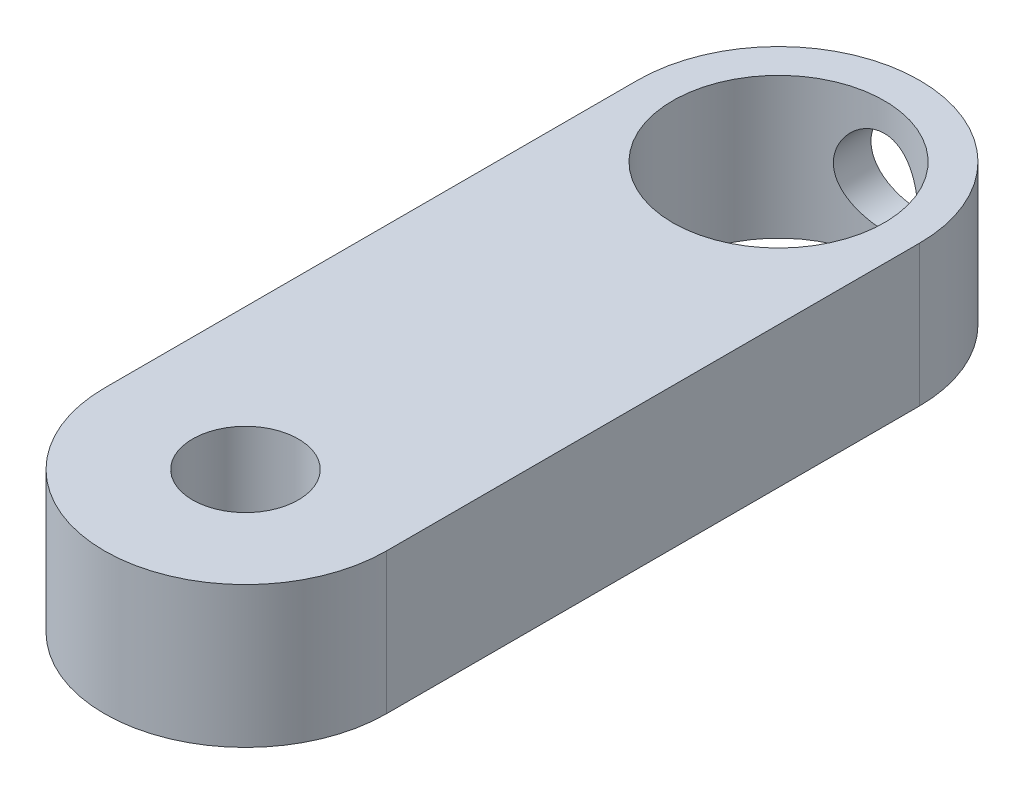
ISO-10303-21;
HEADER;
FILE_DESCRIPTION(('STEP AP214'),'2;1');
FILE_NAME('part.step','',(''),(''),'','','');
FILE_SCHEMA(('AUTOMOTIVE_DESIGN { 1 0 10303 214 1 1 1 1 }'));
ENDSEC;
DATA;
#1=APPLICATION_CONTEXT('core data for automotive mechanical design processes');
#2=APPLICATION_PROTOCOL_DEFINITION('international standard','automotive_design',2000,#1);
#3=PRODUCT_CONTEXT('',#1,'mechanical');
#4=PRODUCT('Part','Part','',(#3));
#5=PRODUCT_RELATED_PRODUCT_CATEGORY('part','',(#4));
#6=PRODUCT_DEFINITION_FORMATION('','',#4);
#7=PRODUCT_DEFINITION_CONTEXT('part definition',#1,'design');
#8=PRODUCT_DEFINITION('design','',#6,#7);
#9=PRODUCT_DEFINITION_SHAPE('','',#8);
#10=(LENGTH_UNIT() NAMED_UNIT(*) SI_UNIT(.MILLI.,.METRE.));
#11=(NAMED_UNIT(*) PLANE_ANGLE_UNIT() SI_UNIT($,.RADIAN.));
#12=(NAMED_UNIT(*) SI_UNIT($,.STERADIAN.) SOLID_ANGLE_UNIT());
#13=UNCERTAINTY_MEASURE_WITH_UNIT(LENGTH_MEASURE(1.E-05),#10,'distance_accuracy_value','');
#14=(GEOMETRIC_REPRESENTATION_CONTEXT(3) GLOBAL_UNCERTAINTY_ASSIGNED_CONTEXT((#13)) GLOBAL_UNIT_ASSIGNED_CONTEXT((#10,
#11,#12)) REPRESENTATION_CONTEXT('',''));
#15=CARTESIAN_POINT('',(0.,0.,0.));
#16=DIRECTION('',(0.,0.,1.));
#17=DIRECTION('',(1.,0.,0.));
#18=AXIS2_PLACEMENT_3D('',#15,#16,#17);
#19=CARTESIAN_POINT('',(0.,6.35,-24.));
#20=DIRECTION('',(0.,1.,0.));
#21=DIRECTION('',(0.,0.,1.));
#22=AXIS2_PLACEMENT_3D('',#19,#20,#21);
#23=PLANE('',#22);
#24=CARTESIAN_POINT('',(0.,6.35,0.));
#25=DIRECTION('',(0.,1.,0.));
#26=DIRECTION('',(0.,0.,1.));
#27=AXIS2_PLACEMENT_3D('',#24,#25,#26);
#28=CIRCLE('',#27,2.38125);
#29=CARTESIAN_POINT('',(0.,6.35,2.38125));
#30=VERTEX_POINT('',#29);
#31=EDGE_CURVE('E108',#30,#30,#28,.T.);
#32=ORIENTED_EDGE('',*,*,#31,.F.);
#33=EDGE_LOOP('',(#32));
#34=FACE_BOUND('',#33,.T.);
#35=CARTESIAN_POINT('',(0.,6.35,-24.));
#36=DIRECTION('',(0.,1.,0.));
#37=DIRECTION('',(0.,0.,1.));
#38=AXIS2_PLACEMENT_3D('',#35,#36,#37);
#39=CIRCLE('',#38,6.35);
#40=CARTESIAN_POINT('',(6.35,6.35,-24.));
#41=VERTEX_POINT('',#40);
#42=CARTESIAN_POINT('',(-6.35,6.35,-24.));
#43=VERTEX_POINT('',#42);
#44=EDGE_CURVE('E127',#41,#43,#39,.T.);
#45=ORIENTED_EDGE('',*,*,#44,.T.);
#46=DIRECTION('',(0.,0.,1.));
#47=VECTOR('',#46,1.);
#48=CARTESIAN_POINT('',(-6.35,6.35,-24.));
#49=LINE('',#48,#47);
#50=CARTESIAN_POINT('',(-6.35,6.35,0.));
#51=VERTEX_POINT('',#50);
#52=EDGE_CURVE('E90',#43,#51,#49,.T.);
#53=ORIENTED_EDGE('',*,*,#52,.T.);
#54=CARTESIAN_POINT('',(0.,6.35,0.));
#55=DIRECTION('',(0.,1.,0.));
#56=DIRECTION('',(0.,0.,1.));
#57=AXIS2_PLACEMENT_3D('',#54,#55,#56);
#58=CIRCLE('',#57,6.35);
#59=CARTESIAN_POINT('',(6.35,6.35,0.));
#60=VERTEX_POINT('',#59);
#61=EDGE_CURVE('E130',#51,#60,#58,.T.);
#62=ORIENTED_EDGE('',*,*,#61,.T.);
#63=DIRECTION('',(0.,0.,-1.));
#64=VECTOR('',#63,1.);
#65=CARTESIAN_POINT('',(6.35,6.35,-24.));
#66=LINE('',#65,#64);
#67=EDGE_CURVE('E58',#60,#41,#66,.T.);
#68=ORIENTED_EDGE('',*,*,#67,.T.);
#69=EDGE_LOOP('',(#45,#53,#62,#68));
#70=FACE_BOUND('',#69,.T.);
#71=CARTESIAN_POINT('',(0.,6.35,-24.));
#72=DIRECTION('',(0.,1.,0.));
#73=DIRECTION('',(0.,0.,1.));
#74=AXIS2_PLACEMENT_3D('',#71,#72,#73);
#75=CIRCLE('',#74,4.7625);
#76=CARTESIAN_POINT('',(0.,6.35,-19.2375));
#77=VERTEX_POINT('',#76);
#78=EDGE_CURVE('E121',#77,#77,#75,.T.);
#79=ORIENTED_EDGE('',*,*,#78,.F.);
#80=EDGE_LOOP('',(#79));
#81=FACE_BOUND('',#80,.T.);
#82=ADVANCED_FACE('F37',(#34,#70,#81),#23,.T.);
#83=CARTESIAN_POINT('',(0.,0.,-24.));
#84=DIRECTION('',(0.,1.,0.));
#85=DIRECTION('',(0.,0.,1.));
#86=AXIS2_PLACEMENT_3D('',#83,#84,#85);
#87=PLANE('',#86);
#88=CARTESIAN_POINT('',(0.,0.,0.));
#89=DIRECTION('',(0.,1.,0.));
#90=DIRECTION('',(0.,0.,1.));
#91=AXIS2_PLACEMENT_3D('',#88,#89,#90);
#92=CIRCLE('',#91,2.38125);
#93=CARTESIAN_POINT('',(0.,0.,2.38125));
#94=VERTEX_POINT('',#93);
#95=EDGE_CURVE('E117',#94,#94,#92,.T.);
#96=ORIENTED_EDGE('',*,*,#95,.T.);
#97=EDGE_LOOP('',(#96));
#98=FACE_BOUND('',#97,.T.);
#99=CARTESIAN_POINT('',(0.,0.,-24.));
#100=DIRECTION('',(0.,1.,0.));
#101=DIRECTION('',(0.,0.,1.));
#102=AXIS2_PLACEMENT_3D('',#99,#100,#101);
#103=CIRCLE('',#102,6.35);
#104=CARTESIAN_POINT('',(6.35,0.,-24.));
#105=VERTEX_POINT('',#104);
#106=CARTESIAN_POINT('',(-6.35,0.,-24.));
#107=VERTEX_POINT('',#106);
#108=EDGE_CURVE('E124',#105,#107,#103,.T.);
#109=ORIENTED_EDGE('',*,*,#108,.F.);
#110=DIRECTION('',(0.,0.,-1.));
#111=VECTOR('',#110,1.);
#112=CARTESIAN_POINT('',(6.35,0.,-24.));
#113=LINE('',#112,#111);
#114=CARTESIAN_POINT('',(6.35,0.,0.));
#115=VERTEX_POINT('',#114);
#116=EDGE_CURVE('E82',#115,#105,#113,.T.);
#117=ORIENTED_EDGE('',*,*,#116,.F.);
#118=CARTESIAN_POINT('',(0.,0.,0.));
#119=DIRECTION('',(0.,1.,0.));
#120=DIRECTION('',(0.,0.,1.));
#121=AXIS2_PLACEMENT_3D('',#118,#119,#120);
#122=CIRCLE('',#121,6.35);
#123=CARTESIAN_POINT('',(-6.35,0.,0.));
#124=VERTEX_POINT('',#123);
#125=EDGE_CURVE('E76',#124,#115,#122,.T.);
#126=ORIENTED_EDGE('',*,*,#125,.F.);
#127=DIRECTION('',(0.,0.,1.));
#128=VECTOR('',#127,1.);
#129=CARTESIAN_POINT('',(-6.35,0.,-24.));
#130=LINE('',#129,#128);
#131=EDGE_CURVE('E136',#107,#124,#130,.T.);
#132=ORIENTED_EDGE('',*,*,#131,.F.);
#133=EDGE_LOOP('',(#109,#117,#126,#132));
#134=FACE_BOUND('',#133,.T.);
#135=CARTESIAN_POINT('',(0.,0.,-24.));
#136=DIRECTION('',(0.,1.,0.));
#137=DIRECTION('',(0.,0.,1.));
#138=AXIS2_PLACEMENT_3D('',#135,#136,#137);
#139=CIRCLE('',#138,4.7625);
#140=CARTESIAN_POINT('',(0.,0.,-19.2375));
#141=VERTEX_POINT('',#140);
#142=EDGE_CURVE('E120',#141,#141,#139,.T.);
#143=ORIENTED_EDGE('',*,*,#142,.T.);
#144=EDGE_LOOP('',(#143));
#145=FACE_BOUND('',#144,.T.);
#146=ADVANCED_FACE('F167',(#98,#134,#145),#87,.F.);
#147=CARTESIAN_POINT('',(0.,6.35,-24.));
#148=DIRECTION('',(0.,-1.,0.));
#149=DIRECTION('',(0.,0.,-1.));
#150=AXIS2_PLACEMENT_3D('',#147,#148,#149);
#151=CYLINDRICAL_SURFACE('',#150,6.35);
#152=CARTESIAN_POINT('',(-1.89865,3.175,-30.0595072553385));
#153=CARTESIAN_POINT('',(-1.8986486602891,3.07094326891506,-30.059508362099));
#154=CARTESIAN_POINT('',(-1.89006656275361,2.96687327440323,-30.0622169525455));
#155=CARTESIAN_POINT('',(-1.85605262289028,2.76177469827084,-30.0727157230268));
#156=CARTESIAN_POINT('',(-1.83061506456021,2.66074716055899,-30.0805076268944));
#157=CARTESIAN_POINT('',(-1.76383019431638,2.4647322835657,-30.1002133418541));
#158=CARTESIAN_POINT('',(-1.72250921229591,2.36973524959816,-30.1121203281104));
#159=CARTESIAN_POINT('',(-1.62521684578364,2.1879987177997,-30.1387053681065));
#160=CARTESIAN_POINT('',(-1.56924329983886,2.10126044082457,-30.1533838305878));
#161=CARTESIAN_POINT('',(-1.442350823399,1.93577681618367,-30.1843754312322));
#162=CARTESIAN_POINT('',(-1.37105165352194,1.8573294565737,-30.2007232188034));
#163=CARTESIAN_POINT('',(-1.21634680114716,1.71330793174197,-30.2329153972725));
#164=CARTESIAN_POINT('',(-1.13293957502026,1.64773541041606,-30.248759723671));
#165=CARTESIAN_POINT('',(-0.95426808669194,1.53003256589154,-30.2785531175324));
#166=CARTESIAN_POINT('',(-0.858795560945125,1.47820583547427,-30.2924565993172));
#167=CARTESIAN_POINT('',(-0.660003889485408,1.39145861715885,-30.3163993455856));
#168=CARTESIAN_POINT('',(-0.556686429697634,1.35653450861177,-30.3264394375372));
#169=CARTESIAN_POINT('',(-0.34825498883519,1.30556935716015,-30.3412789940044));
#170=CARTESIAN_POINT('',(-0.243275575871006,1.28901972937688,-30.3462193254543));
#171=CARTESIAN_POINT('',(-0.0319216940235353,1.27366542303498,-30.3507986892817));
#172=CARTESIAN_POINT('',(0.0744524791004588,1.27485704134953,-30.3504388279676));
#173=CARTESIAN_POINT('',(0.282009208126759,1.29460949532292,-30.3445580402139));
#174=CARTESIAN_POINT('',(0.383249540255708,1.31261961609799,-30.3392007582213));
#175=CARTESIAN_POINT('',(0.581198949737279,1.36459854985856,-30.3241257838877));
#176=CARTESIAN_POINT('',(0.677907740445849,1.3985683708852,-30.3144078161203));
#177=CARTESIAN_POINT('',(0.865360995285921,1.4818768517044,-30.2914766429541));
#178=CARTESIAN_POINT('',(0.95602327327586,1.53138919563102,-30.2782242056997));
#179=CARTESIAN_POINT('',(1.12792903461921,1.64423998939146,-30.2496304703805));
#180=CARTESIAN_POINT('',(1.20917028835805,1.70758170195165,-30.234288679702));
#181=CARTESIAN_POINT('',(1.36321447478767,1.84915153137328,-30.202465153861));
#182=CARTESIAN_POINT('',(1.43557501023548,1.92785690790324,-30.1859622636345));
#183=CARTESIAN_POINT('',(1.56619480309854,2.09644636253307,-30.15419081447));
#184=CARTESIAN_POINT('',(1.62445267849385,2.18633153491509,-30.1389223766023));
#185=CARTESIAN_POINT('',(1.7256707267668,2.37588732610199,-30.1112479752352));
#186=CARTESIAN_POINT('',(1.76848081308384,2.47564254850318,-30.0988704872523));
#187=CARTESIAN_POINT('',(1.83656363554425,2.68140237309722,-30.0787177203967));
#188=CARTESIAN_POINT('',(1.86184204802071,2.78740494047865,-30.070940952042));
#189=CARTESIAN_POINT('',(1.893319070607,2.99844228086355,-30.0611967498317));
#190=CARTESIAN_POINT('',(1.90018977282286,3.10336744661585,-30.0590247902462));
#191=CARTESIAN_POINT('',(1.89653240871971,3.31287428545684,-30.0601707554936));
#192=CARTESIAN_POINT('',(1.88600675854449,3.41745600422486,-30.0634879179537));
#193=CARTESIAN_POINT('',(1.84845383888855,3.62051078113604,-30.0750377291353));
#194=CARTESIAN_POINT('',(1.8218585265992,3.71907179567361,-30.0831415862968));
#195=CARTESIAN_POINT('',(1.75342161272866,3.91032619424281,-30.1032184910947));
#196=CARTESIAN_POINT('',(1.71157766780542,4.00301867385295,-30.1151921333904));
#197=CARTESIAN_POINT('',(1.61255368361553,4.18264071743193,-30.1420568260491));
#198=CARTESIAN_POINT('',(1.55499409715736,4.26935041082504,-30.1570172185565));
#199=CARTESIAN_POINT('',(1.42662408374765,4.43212578840839,-30.1880203682794));
#200=CARTESIAN_POINT('',(1.35581050652143,4.50818893454615,-30.2040633822369));
#201=CARTESIAN_POINT('',(1.1997844495878,4.65044712256741,-30.2361513297272));
#202=CARTESIAN_POINT('',(1.11413201460967,4.71616586941328,-30.2521738304813));
#203=CARTESIAN_POINT('',(0.932633457352183,4.83230851583796,-30.2818100176637));
#204=CARTESIAN_POINT('',(0.836787844099663,4.88273317868864,-30.2954238242869));
#205=CARTESIAN_POINT('',(0.638259815334183,4.96636991025286,-30.318625293596));
#206=CARTESIAN_POINT('',(0.535635337960173,4.99971075873782,-30.3282429722022));
#207=CARTESIAN_POINT('',(0.325901228017517,5.04856479072753,-30.3425010768332));
#208=CARTESIAN_POINT('',(0.218792878336237,5.06408303783766,-30.3471429165258));
#209=CARTESIAN_POINT('',(0.00753454649049519,5.07646836594257,-30.3508408739009));
#210=CARTESIAN_POINT('',(-0.096571810848624,5.07402640389055,-30.3501039302282));
#211=CARTESIAN_POINT('',(-0.302826535456634,5.05221091003836,-30.3436142390601));
#212=CARTESIAN_POINT('',(-0.40497501214683,5.03283832728664,-30.3378617727105));
#213=CARTESIAN_POINT('',(-0.603360373971996,4.97813806615273,-30.3220458352502));
#214=CARTESIAN_POINT('',(-0.699648463014056,4.94298176905753,-30.312028728961));
#215=CARTESIAN_POINT('',(-0.885009886335528,4.8578652584623,-30.2887195790108));
#216=CARTESIAN_POINT('',(-0.974082036438963,4.80790262140026,-30.2754269992673));
#217=CARTESIAN_POINT('',(-1.14556553178505,4.69274683028589,-30.2464379594749));
#218=CARTESIAN_POINT('',(-1.22767448433797,4.62711937566506,-30.2306784341121));
#219=CARTESIAN_POINT('',(-1.37994531768061,4.48328028025935,-30.1987350265173));
#220=CARTESIAN_POINT('',(-1.45010375578932,4.40506502578324,-30.1825510235469));
#221=CARTESIAN_POINT('',(-1.57856319842188,4.23549674556892,-30.1510283735068));
#222=CARTESIAN_POINT('',(-1.63645259133346,4.14382381670446,-30.1357288343291));
#223=CARTESIAN_POINT('',(-1.73593009553797,3.95160516043749,-30.1083323803487));
#224=CARTESIAN_POINT('',(-1.77752613429883,3.85106377719438,-30.0962339090112));
#225=CARTESIAN_POINT('',(-1.83943365776697,3.65532277473778,-30.0778211187922));
#226=CARTESIAN_POINT('',(-1.86157889704889,3.56074627649383,-30.0710180244938));
#227=CARTESIAN_POINT('',(-1.89118624548324,3.36911670432202,-30.0618610151905));
#228=CARTESIAN_POINT('',(-1.89865124968237,3.27206412252037,-30.0595062229523));
#229=CARTESIAN_POINT('',(-1.89865,3.175,-30.0595072553385));
#230=B_SPLINE_CURVE_WITH_KNOTS('',3,(#152,#153,#154,#155,#156,#157,#158,#159,#160,#161,#162,
#163,#164,#165,#166,#167,#168,#169,#170,#171,#172,#173,#174,#175,#176,#177,#178,#179,#180,#181,
#182,#183,#184,#185,#186,#187,#188,#189,#190,#191,#192,#193,#194,#195,#196,#197,#198,#199,#200,
#201,#202,#203,#204,#205,#206,#207,#208,#209,#210,#211,#212,#213,#214,#215,#216,#217,#218,#219,
#220,#221,#222,#223,#224,#225,#226,#227,#228,#229),.UNSPECIFIED.,.T.,.F.,(4,2,2,2,2,2,2,2,2,2,2,
2,2,2,2,2,2,2,2,2,2,2,2,2,2,2,2,2,2,2,2,2,2,2,2,2,2,2,4),(0.,0.31181217424738,0.623730143993151,
0.935133262915572,1.24658234395571,1.56690137708128,1.88726128289036,2.21419791722968,
2.54106448863615,2.85863887687209,3.1761469787978,3.48360985368428,3.79109215104744,
4.10214074924877,4.41326281177626,4.73630164641617,5.05937212512477,5.38550193745209,
5.71152610745592,6.0254732577177,6.33937680816649,6.64519621263725,6.9510626339064,
7.2650934382097,7.57919897792712,7.90506889573817,8.23092254789493,8.55428234135173,
8.8775502418397,9.18844844313183,9.49932921809682,9.80691312636896,10.1145474090622,
10.4319770816063,10.749498044586,11.0764009966181,11.4031446971402,11.6940604809739,
11.9849188883919),.UNSPECIFIED.);
#231=CARTESIAN_POINT('',(-1.89865,3.175,-30.0595072553385));
#232=VERTEX_POINT('',#231);
#233=EDGE_CURVE('E11',#232,#232,#230,.T.);
#234=ORIENTED_EDGE('',*,*,#233,.T.);
#235=EDGE_LOOP('',(#234));
#236=FACE_BOUND('',#235,.T.);
#237=ORIENTED_EDGE('',*,*,#108,.T.);
#238=DIRECTION('',(0.,-1.,0.));
#239=VECTOR('',#238,1.);
#240=CARTESIAN_POINT('',(-6.35,6.35,-24.));
#241=LINE('',#240,#239);
#242=EDGE_CURVE('E50',#43,#107,#241,.T.);
#243=ORIENTED_EDGE('',*,*,#242,.F.);
#244=ORIENTED_EDGE('',*,*,#44,.F.);
#245=DIRECTION('',(0.,-1.,0.));
#246=VECTOR('',#245,1.);
#247=CARTESIAN_POINT('',(6.35,6.35,-24.));
#248=LINE('',#247,#246);
#249=EDGE_CURVE('E133',#41,#105,#248,.T.);
#250=ORIENTED_EDGE('',*,*,#249,.T.);
#251=EDGE_LOOP('',(#237,#243,#244,#250));
#252=FACE_BOUND('',#251,.T.);
#253=ADVANCED_FACE('F39',(#236,#252),#151,.T.);
#254=CARTESIAN_POINT('',(-6.35,6.35,-24.));
#255=DIRECTION('',(1.,0.,0.));
#256=DIRECTION('',(0.,0.,-1.));
#257=AXIS2_PLACEMENT_3D('',#254,#255,#256);
#258=PLANE('',#257);
#259=ORIENTED_EDGE('',*,*,#131,.T.);
#260=DIRECTION('',(0.,-1.,0.));
#261=VECTOR('',#260,1.);
#262=CARTESIAN_POINT('',(-6.35,6.35,0.));
#263=LINE('',#262,#261);
#264=EDGE_CURVE('E143',#51,#124,#263,.T.);
#265=ORIENTED_EDGE('',*,*,#264,.F.);
#266=ORIENTED_EDGE('',*,*,#52,.F.);
#267=ORIENTED_EDGE('',*,*,#242,.T.);
#268=EDGE_LOOP('',(#259,#265,#266,#267));
#269=FACE_BOUND('',#268,.T.);
#270=ADVANCED_FACE('F180',(#269),#258,.F.);
#271=CARTESIAN_POINT('',(0.,6.35,0.));
#272=DIRECTION('',(0.,-1.,0.));
#273=DIRECTION('',(0.,0.,-1.));
#274=AXIS2_PLACEMENT_3D('',#271,#272,#273);
#275=CYLINDRICAL_SURFACE('',#274,6.35);
#276=ORIENTED_EDGE('',*,*,#125,.T.);
#277=DIRECTION('',(0.,-1.,0.));
#278=VECTOR('',#277,1.);
#279=CARTESIAN_POINT('',(6.35,6.35,0.));
#280=LINE('',#279,#278);
#281=EDGE_CURVE('E141',#60,#115,#280,.T.);
#282=ORIENTED_EDGE('',*,*,#281,.F.);
#283=ORIENTED_EDGE('',*,*,#61,.F.);
#284=ORIENTED_EDGE('',*,*,#264,.T.);
#285=EDGE_LOOP('',(#276,#282,#283,#284));
#286=FACE_BOUND('',#285,.T.);
#287=ADVANCED_FACE('F178',(#286),#275,.T.);
#288=CARTESIAN_POINT('',(6.35,6.35,-24.));
#289=DIRECTION('',(-1.,0.,0.));
#290=DIRECTION('',(0.,0.,1.));
#291=AXIS2_PLACEMENT_3D('',#288,#289,#290);
#292=PLANE('',#291);
#293=ORIENTED_EDGE('',*,*,#116,.T.);
#294=ORIENTED_EDGE('',*,*,#249,.F.);
#295=ORIENTED_EDGE('',*,*,#67,.F.);
#296=ORIENTED_EDGE('',*,*,#281,.T.);
#297=EDGE_LOOP('',(#293,#294,#295,#296));
#298=FACE_BOUND('',#297,.T.);
#299=ADVANCED_FACE('F162',(#298),#292,.F.);
#300=CARTESIAN_POINT('',(0.,6.35,-24.));
#301=DIRECTION('',(0.,-1.,0.));
#302=DIRECTION('',(0.,0.,-1.));
#303=AXIS2_PLACEMENT_3D('',#300,#301,#302);
#304=CYLINDRICAL_SURFACE('',#303,4.7625);
#305=CARTESIAN_POINT('',(0.,5.07365,-28.7625));
#306=CARTESIAN_POINT('',(-0.102072732802165,5.07364080153538,-28.7624932046802));
#307=CARTESIAN_POINT('',(-0.204323843263761,5.06536964250239,-28.7591799837866));
#308=CARTESIAN_POINT('',(-0.405945129545353,5.03257103337503,-28.7462498899035));
#309=CARTESIAN_POINT('',(-0.505306676606559,5.00799925704902,-28.7366158294569));
#310=CARTESIAN_POINT('',(-0.697908111979025,4.94363392967774,-28.7120824561553));
#311=CARTESIAN_POINT('',(-0.791166832748211,4.90389007122612,-28.697200344067));
#312=CARTESIAN_POINT('',(-0.969608660348229,4.81050540896039,-28.663638008034));
#313=CARTESIAN_POINT('',(-1.05479458445981,4.7568694778398,-28.6449591163165));
#314=CARTESIAN_POINT('',(-1.21878627258539,4.63456695708534,-28.6047148120807));
#315=CARTESIAN_POINT('',(-1.29716427102273,4.56535634140162,-28.5830602008277));
#316=CARTESIAN_POINT('',(-1.44156213674204,4.41501719857748,-28.5397136467704));
#317=CARTESIAN_POINT('',(-1.50757599303174,4.33388290861451,-28.5180216909554));
#318=CARTESIAN_POINT('',(-1.62824076342582,4.1576495607817,-28.4759922405204));
#319=CARTESIAN_POINT('',(-1.6822614591727,4.06209215911064,-28.4557568028506));
#320=CARTESIAN_POINT('',(-1.77327244583728,3.86231971019169,-28.4203296332152));
#321=CARTESIAN_POINT('',(-1.81027077163231,3.75810877505197,-28.4051355225952));
#322=CARTESIAN_POINT('',(-1.86445971420239,3.54890130872236,-28.3824683490921));
#323=CARTESIAN_POINT('',(-1.88246882310001,3.44415243344664,-28.3746778102169));
#324=CARTESIAN_POINT('',(-1.90072498055104,3.23285207075818,-28.3667791412241));
#325=CARTESIAN_POINT('',(-1.90098068369468,3.12630148699867,-28.3666672678416));
#326=CARTESIAN_POINT('',(-1.88434337128059,2.92226692464861,-28.3738675816774));
#327=CARTESIAN_POINT('',(-1.86863324524976,2.824664916356,-28.3806676753853));
#328=CARTESIAN_POINT('',(-1.82248163889271,2.6336186469878,-28.4000666866163));
#329=CARTESIAN_POINT('',(-1.79203760696595,2.54017510913305,-28.4126666085283));
#330=CARTESIAN_POINT('',(-1.71670425822983,2.3578531471995,-28.4425214620576));
#331=CARTESIAN_POINT('',(-1.67153379473005,2.26910618892839,-28.4598658401904));
#332=CARTESIAN_POINT('',(-1.56822711507661,2.10012715569128,-28.4972304662632));
#333=CARTESIAN_POINT('',(-1.51008604968095,2.01989828193135,-28.5172517138638));
#334=CARTESIAN_POINT('',(-1.37724352720787,1.86375378848542,-28.5595857320369));
#335=CARTESIAN_POINT('',(-1.3016135996436,1.78864168231487,-28.5819564463184));
#336=CARTESIAN_POINT('',(-1.1385915471098,1.65191058103612,-28.6251616608585));
#337=CARTESIAN_POINT('',(-1.05119711597625,1.59029423770323,-28.6459958586753));
#338=CARTESIAN_POINT('',(-0.864860340326759,1.48125869478683,-28.6842962950537));
#339=CARTESIAN_POINT('',(-0.765725983758226,1.43413989042834,-28.7016889056565));
#340=CARTESIAN_POINT('',(-0.56006876149548,1.3575240379876,-28.7305904223575));
#341=CARTESIAN_POINT('',(-0.453549653563,1.32801809992427,-28.7421022962958));
#342=CARTESIAN_POINT('',(-0.242883236480856,1.28908618898003,-28.7574054095531));
#343=CARTESIAN_POINT('',(-0.138965516674093,1.27858027463064,-28.761611301448));
#344=CARTESIAN_POINT('',(0.0692230130654873,1.27476023620739,-28.7631333664281));
#345=CARTESIAN_POINT('',(0.173493725342498,1.28144169250876,-28.7604513107061));
#346=CARTESIAN_POINT('',(0.374545841677286,1.31101115589198,-28.7487703832846));
#347=CARTESIAN_POINT('',(0.471453916112842,1.33316360261081,-28.7400583650246));
#348=CARTESIAN_POINT('',(0.660089318303662,1.39204713458109,-28.7174907314058));
#349=CARTESIAN_POINT('',(0.75181597811281,1.42878009455746,-28.7036344546263));
#350=CARTESIAN_POINT('',(0.93063573707924,1.51697950858566,-28.671598293187));
#351=CARTESIAN_POINT('',(1.01750180423996,1.56886162686769,-28.6532992992416));
#352=CARTESIAN_POINT('',(1.18159938142141,1.68542500270759,-28.6143637818508));
#353=CARTESIAN_POINT('',(1.25882702485215,1.75011137013257,-28.5937263265922));
#354=CARTESIAN_POINT('',(1.40676849112361,1.89542364475556,-28.5506845286148));
#355=CARTESIAN_POINT('',(1.47672286536862,1.97681672909769,-28.5282530773816));
#356=CARTESIAN_POINT('',(1.60216466315788,2.15058594415806,-28.485407477204));
#357=CARTESIAN_POINT('',(1.65764976830204,2.24296383151471,-28.4649936518673));
#358=CARTESIAN_POINT('',(1.75291129851249,2.43743700296833,-28.4284701661246));
#359=CARTESIAN_POINT('',(1.79253593434841,2.53961509860139,-28.4124025517561));
#360=CARTESIAN_POINT('',(1.85371249744202,2.75002661694713,-28.3870575079361));
#361=CARTESIAN_POINT('',(1.87527764257337,2.85825554900688,-28.3777751129666));
#362=CARTESIAN_POINT('',(1.89846491888752,3.06935166640878,-28.3677662337388));
#363=CARTESIAN_POINT('',(1.90140364517338,3.17204837334292,-28.3664750630374));
#364=CARTESIAN_POINT('',(1.89070740446982,3.37639828978767,-28.3711172132815));
#365=CARTESIAN_POINT('',(1.87707451072722,3.47805162822792,-28.3770496304965));
#366=CARTESIAN_POINT('',(1.83469465796553,3.67336708013021,-28.3949738916414));
#367=CARTESIAN_POINT('',(1.80655821088816,3.76718623785839,-28.4067202625799));
#368=CARTESIAN_POINT('',(1.73653918240864,3.94881089060782,-28.4347776795358));
#369=CARTESIAN_POINT('',(1.69465281035338,4.03661471921349,-28.4510899841315));
#370=CARTESIAN_POINT('',(1.59556302961161,4.20916943559251,-28.4875962911184));
#371=CARTESIAN_POINT('',(1.5376224923271,4.29346084975139,-28.5079585796732));
#372=CARTESIAN_POINT('',(1.40915029870134,4.45153756604174,-28.5497538862595));
#373=CARTESIAN_POINT('',(1.33861489353107,4.52531972833559,-28.5711872217137));
#374=CARTESIAN_POINT('',(1.18156183782342,4.66514480685578,-28.6143644023671));
#375=CARTESIAN_POINT('',(1.09430870289323,4.73038639751715,-28.6360397903825));
#376=CARTESIAN_POINT('',(0.909270204909277,4.84531644736218,-28.6758502727488));
#377=CARTESIAN_POINT('',(0.811479961404766,4.89499765749735,-28.6939837155526));
#378=CARTESIAN_POINT('',(0.609952904380794,4.97622653980655,-28.7243578129618));
#379=CARTESIAN_POINT('',(0.50636206196391,5.00809690804317,-28.7367026330161));
#380=CARTESIAN_POINT('',(0.294897527592459,5.0537046390349,-28.7545358813858));
#381=CARTESIAN_POINT('',(0.187038574839199,5.06749960429901,-28.7600460871688));
#382=CARTESIAN_POINT('',(0.0526410833954365,5.07310514197015,-28.762283554918));
#383=CARTESIAN_POINT('',(0.0263264747257128,5.07365237245677,-28.7625017526406));
#384=CARTESIAN_POINT('',(0.,5.07365,-28.7625));
#385=B_SPLINE_CURVE_WITH_KNOTS('',3,(#305,#306,#307,#308,#309,#310,#311,#312,#313,#314,#315,
#316,#317,#318,#319,#320,#321,#322,#323,#324,#325,#326,#327,#328,#329,#330,#331,#332,#333,#334,
#335,#336,#337,#338,#339,#340,#341,#342,#343,#344,#345,#346,#347,#348,#349,#350,#351,#352,#353,
#354,#355,#356,#357,#358,#359,#360,#361,#362,#363,#364,#365,#366,#367,#368,#369,#370,#371,#372,
#373,#374,#375,#376,#377,#378,#379,#380,#381,#382,#383,#384),.UNSPECIFIED.,.T.,.F.,(4,2,2,2,2,2,
2,2,2,2,2,2,2,2,2,2,2,2,2,2,2,2,2,2,2,2,2,2,2,2,2,2,2,2,2,2,2,2,2,4),(0.,0.30614825378095,
0.613132447174015,0.919119694629608,1.22499976097994,1.54394122193961,1.86303734032263,
2.19621911645722,2.52924346279921,2.84723993037011,3.16508137706849,3.46097606376103,
3.75692201149442,4.05888581395966,4.36096269959934,4.68622177111353,5.01154469539099,
5.34321379395449,5.67471534280484,5.98669955955126,6.29860355952908,6.59660670766995,
6.89464818470764,7.20179098568956,7.5090566079807,7.83647522984816,8.1639462815654,
8.49448040831552,8.82477240275465,9.13143057243015,9.43805038057875,9.73270580401243,
10.0274425279509,10.3389833366048,10.6506170295979,10.9822641672415,11.3140655789075,
11.639642486308,11.964179304599,12.0431406887437),.UNSPECIFIED.);
#386=CARTESIAN_POINT('',(0.,5.07365,-28.7625));
#387=VERTEX_POINT('',#386);
#388=EDGE_CURVE('E105',#387,#387,#385,.T.);
#389=ORIENTED_EDGE('',*,*,#388,.F.);
#390=EDGE_LOOP('',(#389));
#391=FACE_BOUND('',#390,.T.);
#392=CARTESIAN_POINT('',(-1.35254999999999,3.175,-19.4335993662952));
#393=CARTESIAN_POINT('',(-1.35254861580889,3.24931024544598,-19.433598298891));
#394=CARTESIAN_POINT('',(-1.34640514603426,3.32363453361267,-19.4317656173283));
#395=CARTESIAN_POINT('',(-1.32204854036095,3.47012321244555,-19.424658500153));
#396=CARTESIAN_POINT('',(-1.3038303907103,3.54228669286759,-19.4193826348461));
#397=CARTESIAN_POINT('',(-1.2559824343459,3.68231282739455,-19.406033815066));
#398=CARTESIAN_POINT('',(-1.2263701465237,3.75018189867441,-19.397965156515));
#399=CARTESIAN_POINT('',(-1.1566308270314,3.88000260779973,-19.3799455270785));
#400=CARTESIAN_POINT('',(-1.11650258599324,3.94195356392425,-19.3699943397327));
#401=CARTESIAN_POINT('',(-1.02565266091116,4.05993639736763,-19.3490144947677));
#402=CARTESIAN_POINT('',(-0.97468555693714,4.11577558543527,-19.3379647405446));
#403=CARTESIAN_POINT('',(-0.864131554174427,4.21823994930089,-19.3162139134546));
#404=CARTESIAN_POINT('',(-0.804543658559054,4.26486405807718,-19.3055128810862));
#405=CARTESIAN_POINT('',(-0.677085864911764,4.34839505448928,-19.2854276501633));
#406=CARTESIAN_POINT('',(-0.609084035352392,4.38510789166333,-19.2760712247815));
#407=CARTESIAN_POINT('',(-0.46756191394427,4.44650438889986,-19.2599730217085));
#408=CARTESIAN_POINT('',(-0.394042686209799,4.4711903616808,-19.2532307413786));
#409=CARTESIAN_POINT('',(-0.245586420007763,4.50720165752415,-19.2432697206698));
#410=CARTESIAN_POINT('',(-0.170734935147037,4.51885533860601,-19.2399645384993));
#411=CARTESIAN_POINT('',(-0.0200711654661531,4.52950695042054,-19.2369467801108));
#412=CARTESIAN_POINT('',(0.055740935108297,4.52850727242745,-19.2372335250782));
#413=CARTESIAN_POINT('',(0.203879289622466,4.51410630378992,-19.2413051036859));
#414=CARTESIAN_POINT('',(0.276243250670253,4.50106017691209,-19.2449897533692));
#415=CARTESIAN_POINT('',(0.417709011336022,4.46351364461368,-19.2553231328864));
#416=CARTESIAN_POINT('',(0.486810613233009,4.4390125459231,-19.2619720421202));
#417=CARTESIAN_POINT('',(0.620665033726602,4.3789956289372,-19.2776303279595));
#418=CARTESIAN_POINT('',(0.685362555118472,4.34336322453581,-19.2866645246077));
#419=CARTESIAN_POINT('',(0.807977279711238,4.2621859655313,-19.3061275399357));
#420=CARTESIAN_POINT('',(0.865893007702631,4.21663896039216,-19.3165566609935));
#421=CARTESIAN_POINT('',(0.975420507985117,4.11506156353127,-19.3381133055707));
#422=CARTESIAN_POINT('',(1.02674391113113,4.05872232176579,-19.3492525063339));
#423=CARTESIAN_POINT('',(1.1192902785718,3.93812413940395,-19.3706525448852));
#424=CARTESIAN_POINT('',(1.16051244355562,3.8738645726767,-19.3809133131212));
#425=CARTESIAN_POINT('',(1.23194597232205,3.73855732997774,-19.3994463517704));
#426=CARTESIAN_POINT('',(1.26206888067419,3.6674605849201,-19.407702475979));
#427=CARTESIAN_POINT('',(1.30983492290815,3.52091691798093,-19.4210960846828));
#428=CARTESIAN_POINT('',(1.32748163737678,3.44547125093997,-19.4262344638906));
#429=CARTESIAN_POINT('',(1.34927620380854,3.29509267692595,-19.4326172195081));
#430=CARTESIAN_POINT('',(1.35385838351382,3.22022797139494,-19.4339868317884));
#431=CARTESIAN_POINT('',(1.350598734021,3.07079991857426,-19.4330215042419));
#432=CARTESIAN_POINT('',(1.34275843300385,2.99623653534793,-19.4306870200832));
#433=CARTESIAN_POINT('',(1.31526134577482,2.85127010192308,-19.4226985130617));
#434=CARTESIAN_POINT('',(1.29587496560654,2.78081115466822,-19.4171205209246));
#435=CARTESIAN_POINT('',(1.24614483842483,2.64414758869564,-19.4033500618669));
#436=CARTESIAN_POINT('',(1.21579952373472,2.57794358024422,-19.3951572209113));
#437=CARTESIAN_POINT('',(1.14416076222796,2.44987767558188,-19.3768303713368));
#438=CARTESIAN_POINT('',(1.10261737496508,2.38816184073578,-19.3666537339086));
#439=CARTESIAN_POINT('',(1.01006488194862,2.27241823151963,-19.3456017239474));
#440=CARTESIAN_POINT('',(0.959053749847738,2.21839210733245,-19.3347262021612));
#441=CARTESIAN_POINT('',(0.846987959883299,2.11770984926331,-19.3130632880085));
#442=CARTESIAN_POINT('',(0.78565532638774,2.0713591968718,-19.3022909013535));
#443=CARTESIAN_POINT('',(0.655832022435878,1.9896060210984,-19.2824162606732));
#444=CARTESIAN_POINT('',(0.587341727770117,1.95420292333546,-19.2733139190365));
#445=CARTESIAN_POINT('',(0.445622834606289,1.89568695902828,-19.2578630496653));
#446=CARTESIAN_POINT('',(0.372435022288982,1.87248106955383,-19.2514937488264));
#447=CARTESIAN_POINT('',(0.222987788750546,1.83876208529715,-19.2421348782126));
#448=CARTESIAN_POINT('',(0.14672915251611,1.8282457677312,-19.2391444503142));
#449=CARTESIAN_POINT('',(-0.00385729695052145,1.82042852136919,-19.2369267669727));
#450=CARTESIAN_POINT('',(-0.0781604271236378,1.82268220035672,-19.2375726780422));
#451=CARTESIAN_POINT('',(-0.225286032097937,1.83929133838319,-19.2422621318706));
#452=CARTESIAN_POINT('',(-0.298108576166484,1.85364622994169,-19.2463055153067));
#453=CARTESIAN_POINT('',(-0.439594476876525,1.89378569245135,-19.2573046706894));
#454=CARTESIAN_POINT('',(-0.508288619761361,1.91946928083909,-19.2642346818891));
#455=CARTESIAN_POINT('',(-0.640430762275762,1.98144725957759,-19.2802870761659));
#456=CARTESIAN_POINT('',(-0.703877954235129,2.01774327962852,-19.2894097959284));
#457=CARTESIAN_POINT('',(-0.82575430619519,2.10115928683878,-19.309215114383));
#458=CARTESIAN_POINT('',(-0.883980546503699,2.14856667005542,-19.3199357522835));
#459=CARTESIAN_POINT('',(-0.991801184959506,2.25232868758608,-19.3415917870058));
#460=CARTESIAN_POINT('',(-1.04139320170823,2.30868578214374,-19.3525272421538));
#461=CARTESIAN_POINT('',(-1.13181737034728,2.43049904320613,-19.373704242741));
#462=CARTESIAN_POINT('',(-1.17238980416485,2.49615283649904,-19.3839205280539));
#463=CARTESIAN_POINT('',(-1.2418677215508,2.63363135604958,-19.4021234479999));
#464=CARTESIAN_POINT('',(-1.27077983978156,2.70545254478997,-19.4101113497724));
#465=CARTESIAN_POINT('',(-1.31292098259455,2.84319572356248,-19.4220030935922));
#466=CARTESIAN_POINT('',(-1.32774401138577,2.90859878237128,-19.4263136117448));
#467=CARTESIAN_POINT('',(-1.34755839051794,3.04099758527195,-19.4321120129773));
#468=CARTESIAN_POINT('',(-1.3525512481506,3.10799308359531,-19.4336003287932));
#469=CARTESIAN_POINT('',(-1.35254999999999,3.175,-19.4335993662952));
#470=B_SPLINE_CURVE_WITH_KNOTS('',3,(#392,#393,#394,#395,#396,#397,#398,#399,#400,#401,#402,
#403,#404,#405,#406,#407,#408,#409,#410,#411,#412,#413,#414,#415,#416,#417,#418,#419,#420,#421,
#422,#423,#424,#425,#426,#427,#428,#429,#430,#431,#432,#433,#434,#435,#436,#437,#438,#439,#440,
#441,#442,#443,#444,#445,#446,#447,#448,#449,#450,#451,#452,#453,#454,#455,#456,#457,#458,#459,
#460,#461,#462,#463,#464,#465,#466,#467,#468,#469),.UNSPECIFIED.,.T.,.F.,(4,2,2,2,2,2,2,2,2,2,2,
2,2,2,2,2,2,2,2,2,2,2,2,2,2,2,2,2,2,2,2,2,2,2,2,2,2,2,4),(0.,0.222683955827818,
0.445460434371463,0.667895746119747,0.890356649870891,1.11852626653287,1.34672228768601,
1.5791065058643,1.81144601982123,2.03778953600667,2.26409027767398,2.48392499482254,
2.70377301838039,2.92600556941737,3.14828637213763,3.37827786679128,3.60828755479596,
3.84009256619206,4.07183102401665,4.29577011256106,4.51968165484572,4.73854477397855,
4.95743921391211,5.18169485524017,5.40599854865826,5.63777465892271,5.86953860661722,
6.09950835682952,6.329419689085,6.5513626580728,6.77329521973291,6.99328826883898,
7.21331511898052,7.43982454272073,7.66639634122325,7.89882776303314,8.13112674528154,
8.3319557641237,8.53275398680843),.UNSPECIFIED.);
#471=CARTESIAN_POINT('',(-1.35254999999999,3.175,-19.4335993662952));
#472=VERTEX_POINT('',#471);
#473=EDGE_CURVE('E104',#472,#472,#470,.T.);
#474=ORIENTED_EDGE('',*,*,#473,.F.);
#475=EDGE_LOOP('',(#474));
#476=FACE_BOUND('',#475,.T.);
#477=ORIENTED_EDGE('',*,*,#78,.T.);
#478=EDGE_LOOP('',(#477));
#479=FACE_BOUND('',#478,.T.);
#480=ORIENTED_EDGE('',*,*,#142,.F.);
#481=EDGE_LOOP('',(#480));
#482=FACE_BOUND('',#481,.T.);
#483=ADVANCED_FACE('F148',(#391,#476,#479,#482),#304,.F.);
#484=CARTESIAN_POINT('',(0.,6.35,0.));
#485=DIRECTION('',(0.,1.,0.));
#486=DIRECTION('',(0.,0.,1.));
#487=AXIS2_PLACEMENT_3D('',#484,#485,#486);
#488=CYLINDRICAL_SURFACE('',#487,2.38125);
#489=ORIENTED_EDGE('',*,*,#95,.F.);
#490=EDGE_LOOP('',(#489));
#491=FACE_BOUND('',#490,.T.);
#492=ORIENTED_EDGE('',*,*,#31,.T.);
#493=EDGE_LOOP('',(#492));
#494=FACE_BOUND('',#493,.T.);
#495=ADVANCED_FACE('F98',(#491,#494),#488,.F.);
#496=CARTESIAN_POINT('',(0.,3.175,-7.99799999999999));
#497=DIRECTION('',(0.,0.,-1.));
#498=DIRECTION('',(-1.,0.,0.));
#499=AXIS2_PLACEMENT_3D('',#496,#497,#498);
#500=CONICAL_SURFACE('',#499,1.35255,1.02974425867665);
#501=CARTESIAN_POINT('',(0.,3.175,-7.18530596973427));
#502=VERTEX_POINT('',#501);
#503=VERTEX_LOOP('',#502);
#504=FACE_BOUND('',#503,.T.);
#505=CARTESIAN_POINT('',(0.,3.175,-7.99799999999999));
#506=DIRECTION('',(0.,0.,-1.));
#507=DIRECTION('',(-1.,0.,0.));
#508=AXIS2_PLACEMENT_3D('',#505,#506,#507);
#509=CIRCLE('',#508,1.35255);
#510=CARTESIAN_POINT('',(-1.35255,3.175,-7.99799999999999));
#511=VERTEX_POINT('',#510);
#512=EDGE_CURVE('E102',#511,#511,#509,.T.);
#513=ORIENTED_EDGE('',*,*,#512,.T.);
#514=EDGE_LOOP('',(#513));
#515=FACE_BOUND('',#514,.T.);
#516=ADVANCED_FACE('F94',(#504,#515),#500,.F.);
#517=CARTESIAN_POINT('',(0.,3.175,-30.35));
#518=DIRECTION('',(0.,0.,-1.));
#519=DIRECTION('',(-1.,0.,0.));
#520=AXIS2_PLACEMENT_3D('',#517,#518,#519);
#521=CYLINDRICAL_SURFACE('',#520,1.35254999999999);
#522=ORIENTED_EDGE('',*,*,#473,.T.);
#523=EDGE_LOOP('',(#522));
#524=FACE_BOUND('',#523,.T.);
#525=ORIENTED_EDGE('',*,*,#512,.F.);
#526=EDGE_LOOP('',(#525));
#527=FACE_BOUND('',#526,.T.);
#528=ADVANCED_FACE('F97',(#524,#527),#521,.F.);
#529=CARTESIAN_POINT('',(0.,3.175,-30.35));
#530=DIRECTION('',(0.,0.,-1.));
#531=DIRECTION('',(-1.,0.,0.));
#532=AXIS2_PLACEMENT_3D('',#529,#530,#531);
#533=CYLINDRICAL_SURFACE('',#532,1.89865);
#534=ORIENTED_EDGE('',*,*,#388,.T.);
#535=EDGE_LOOP('',(#534));
#536=FACE_BOUND('',#535,.T.);
#537=ORIENTED_EDGE('',*,*,#233,.F.);
#538=EDGE_LOOP('',(#537));
#539=FACE_BOUND('',#538,.T.);
#540=ADVANCED_FACE('F154',(#536,#539),#533,.F.);
#541=CLOSED_SHELL('',(#82,#146,#253,#270,#287,#299,#483,#495,#516,#528,#540));
#542=MANIFOLD_SOLID_BREP('B2',#541);
#543=ADVANCED_BREP_SHAPE_REPRESENTATION('',(#18,#542),#14);
#544=SHAPE_DEFINITION_REPRESENTATION(#9,#543);
ENDSEC;
END-ISO-10303-21;
